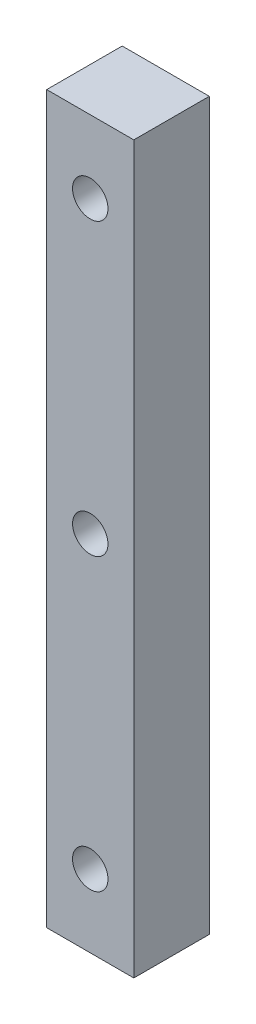
ISO-10303-21;
HEADER;
FILE_DESCRIPTION(('STEP AP214'),'2;1');
FILE_NAME('part.step','',(''),(''),'','','');
FILE_SCHEMA(('AUTOMOTIVE_DESIGN { 1 0 10303 214 1 1 1 1 }'));
ENDSEC;
DATA;
#1=APPLICATION_CONTEXT('core data for automotive mechanical design processes');
#2=APPLICATION_PROTOCOL_DEFINITION('international standard','automotive_design',2000,#1);
#3=PRODUCT_CONTEXT('',#1,'mechanical');
#4=PRODUCT('Part','Part','',(#3));
#5=PRODUCT_RELATED_PRODUCT_CATEGORY('part','',(#4));
#6=PRODUCT_DEFINITION_FORMATION('','',#4);
#7=PRODUCT_DEFINITION_CONTEXT('part definition',#1,'design');
#8=PRODUCT_DEFINITION('design','',#6,#7);
#9=PRODUCT_DEFINITION_SHAPE('','',#8);
#10=(LENGTH_UNIT() NAMED_UNIT(*) SI_UNIT(.MILLI.,.METRE.));
#11=(NAMED_UNIT(*) PLANE_ANGLE_UNIT() SI_UNIT($,.RADIAN.));
#12=(NAMED_UNIT(*) SI_UNIT($,.STERADIAN.) SOLID_ANGLE_UNIT());
#13=UNCERTAINTY_MEASURE_WITH_UNIT(LENGTH_MEASURE(1.E-05),#10,'distance_accuracy_value','');
#14=(GEOMETRIC_REPRESENTATION_CONTEXT(3) GLOBAL_UNCERTAINTY_ASSIGNED_CONTEXT((#13)) GLOBAL_UNIT_ASSIGNED_CONTEXT((#10,
#11,#12)) REPRESENTATION_CONTEXT('',''));
#15=CARTESIAN_POINT('',(0.,0.,0.));
#16=DIRECTION('',(0.,0.,1.));
#17=DIRECTION('',(1.,0.,0.));
#18=AXIS2_PLACEMENT_3D('',#15,#16,#17);
#19=CARTESIAN_POINT('',(0.,25.,0.));
#20=DIRECTION('',(1.,0.,0.));
#21=DIRECTION('',(0.,0.,-1.));
#22=AXIS2_PLACEMENT_3D('',#19,#20,#21);
#23=PLANE('',#22);
#24=DIRECTION('',(0.,0.,1.));
#25=VECTOR('',#24,1.);
#26=CARTESIAN_POINT('',(0.,0.,0.));
#27=LINE('',#26,#25);
#28=CARTESIAN_POINT('',(0.,0.,-2.6));
#29=VERTEX_POINT('',#28);
#30=CARTESIAN_POINT('',(0.,0.,0.));
#31=VERTEX_POINT('',#30);
#32=EDGE_CURVE('E96',#29,#31,#27,.T.);
#33=ORIENTED_EDGE('',*,*,#32,.T.);
#34=DIRECTION('',(0.,-1.,0.));
#35=VECTOR('',#34,1.);
#36=CARTESIAN_POINT('',(0.,25.,0.));
#37=LINE('',#36,#35);
#38=CARTESIAN_POINT('',(0.,25.,0.));
#39=VERTEX_POINT('',#38);
#40=EDGE_CURVE('E11',#39,#31,#37,.T.);
#41=ORIENTED_EDGE('',*,*,#40,.F.);
#42=DIRECTION('',(0.,0.,1.));
#43=VECTOR('',#42,1.);
#44=CARTESIAN_POINT('',(0.,25.,0.));
#45=LINE('',#44,#43);
#46=CARTESIAN_POINT('',(0.,25.,-2.6));
#47=VERTEX_POINT('',#46);
#48=EDGE_CURVE('E84',#47,#39,#45,.T.);
#49=ORIENTED_EDGE('',*,*,#48,.F.);
#50=DIRECTION('',(0.,-1.,0.));
#51=VECTOR('',#50,1.);
#52=CARTESIAN_POINT('',(0.,25.,-2.6));
#53=LINE('',#52,#51);
#54=EDGE_CURVE('E92',#47,#29,#53,.T.);
#55=ORIENTED_EDGE('',*,*,#54,.T.);
#56=EDGE_LOOP('',(#33,#41,#49,#55));
#57=FACE_BOUND('',#56,.T.);
#58=ADVANCED_FACE('F33',(#57),#23,.F.);
#59=CARTESIAN_POINT('',(0.,25.,0.));
#60=DIRECTION('',(0.,0.,-1.));
#61=DIRECTION('',(-1.,0.,0.));
#62=AXIS2_PLACEMENT_3D('',#59,#60,#61);
#63=PLANE('',#62);
#64=CARTESIAN_POINT('',(1.5,22.5,0.));
#65=DIRECTION('',(0.,0.,1.));
#66=DIRECTION('',(1.,0.,0.));
#67=AXIS2_PLACEMENT_3D('',#64,#65,#66);
#68=CIRCLE('',#67,0.610000000000003);
#69=CARTESIAN_POINT('',(2.11,22.5,0.));
#70=VERTEX_POINT('',#69);
#71=EDGE_CURVE('E122',#70,#70,#68,.T.);
#72=ORIENTED_EDGE('',*,*,#71,.F.);
#73=EDGE_LOOP('',(#72));
#74=FACE_BOUND('',#73,.T.);
#75=CARTESIAN_POINT('',(1.5,12.5,0.));
#76=DIRECTION('',(0.,0.,1.));
#77=DIRECTION('',(1.,0.,0.));
#78=AXIS2_PLACEMENT_3D('',#75,#76,#77);
#79=CIRCLE('',#78,0.61);
#80=CARTESIAN_POINT('',(2.11,12.5,0.));
#81=VERTEX_POINT('',#80);
#82=EDGE_CURVE('E116',#81,#81,#79,.T.);
#83=ORIENTED_EDGE('',*,*,#82,.F.);
#84=EDGE_LOOP('',(#83));
#85=FACE_BOUND('',#84,.T.);
#86=CARTESIAN_POINT('',(1.5,2.5,0.));
#87=DIRECTION('',(0.,0.,1.));
#88=DIRECTION('',(1.,0.,0.));
#89=AXIS2_PLACEMENT_3D('',#86,#87,#88);
#90=CIRCLE('',#89,0.61);
#91=CARTESIAN_POINT('',(2.11,2.5,0.));
#92=VERTEX_POINT('',#91);
#93=EDGE_CURVE('E110',#92,#92,#90,.T.);
#94=ORIENTED_EDGE('',*,*,#93,.F.);
#95=EDGE_LOOP('',(#94));
#96=FACE_BOUND('',#95,.T.);
#97=DIRECTION('',(1.,0.,0.));
#98=VECTOR('',#97,1.);
#99=CARTESIAN_POINT('',(0.,0.,0.));
#100=LINE('',#99,#98);
#101=CARTESIAN_POINT('',(3.,0.,0.));
#102=VERTEX_POINT('',#101);
#103=EDGE_CURVE('E88',#31,#102,#100,.T.);
#104=ORIENTED_EDGE('',*,*,#103,.T.);
#105=DIRECTION('',(0.,-1.,0.));
#106=VECTOR('',#105,1.);
#107=CARTESIAN_POINT('',(3.,25.,0.));
#108=LINE('',#107,#106);
#109=CARTESIAN_POINT('',(3.,25.,0.));
#110=VERTEX_POINT('',#109);
#111=EDGE_CURVE('E41',#110,#102,#108,.T.);
#112=ORIENTED_EDGE('',*,*,#111,.F.);
#113=DIRECTION('',(1.,0.,0.));
#114=VECTOR('',#113,1.);
#115=CARTESIAN_POINT('',(0.,25.,0.));
#116=LINE('',#115,#114);
#117=EDGE_CURVE('E79',#39,#110,#116,.T.);
#118=ORIENTED_EDGE('',*,*,#117,.F.);
#119=ORIENTED_EDGE('',*,*,#40,.T.);
#120=EDGE_LOOP('',(#104,#112,#118,#119));
#121=FACE_BOUND('',#120,.T.);
#122=ADVANCED_FACE('F87',(#74,#85,#96,#121),#63,.F.);
#123=CARTESIAN_POINT('',(3.,25.,0.));
#124=DIRECTION('',(-1.,0.,0.));
#125=DIRECTION('',(0.,0.,1.));
#126=AXIS2_PLACEMENT_3D('',#123,#124,#125);
#127=PLANE('',#126);
#128=DIRECTION('',(0.,0.,-1.));
#129=VECTOR('',#128,1.);
#130=CARTESIAN_POINT('',(3.,0.,0.));
#131=LINE('',#130,#129);
#132=CARTESIAN_POINT('',(3.,0.,-2.6));
#133=VERTEX_POINT('',#132);
#134=EDGE_CURVE('E66',#102,#133,#131,.T.);
#135=ORIENTED_EDGE('',*,*,#134,.T.);
#136=DIRECTION('',(0.,-1.,0.));
#137=VECTOR('',#136,1.);
#138=CARTESIAN_POINT('',(3.,25.,-2.6));
#139=LINE('',#138,#137);
#140=CARTESIAN_POINT('',(3.,25.,-2.6));
#141=VERTEX_POINT('',#140);
#142=EDGE_CURVE('E89',#141,#133,#139,.T.);
#143=ORIENTED_EDGE('',*,*,#142,.F.);
#144=DIRECTION('',(0.,0.,-1.));
#145=VECTOR('',#144,1.);
#146=CARTESIAN_POINT('',(3.,25.,0.));
#147=LINE('',#146,#145);
#148=EDGE_CURVE('E82',#110,#141,#147,.T.);
#149=ORIENTED_EDGE('',*,*,#148,.F.);
#150=ORIENTED_EDGE('',*,*,#111,.T.);
#151=EDGE_LOOP('',(#135,#143,#149,#150));
#152=FACE_BOUND('',#151,.T.);
#153=ADVANCED_FACE('F90',(#152),#127,.F.);
#154=CARTESIAN_POINT('',(0.,25.,-2.6));
#155=DIRECTION('',(0.,0.,1.));
#156=DIRECTION('',(1.,0.,0.));
#157=AXIS2_PLACEMENT_3D('',#154,#155,#156);
#158=PLANE('',#157);
#159=CARTESIAN_POINT('',(1.5,22.5,-2.6));
#160=DIRECTION('',(0.,0.,1.));
#161=DIRECTION('',(1.,0.,0.));
#162=AXIS2_PLACEMENT_3D('',#159,#160,#161);
#163=CIRCLE('',#162,0.610000000000003);
#164=CARTESIAN_POINT('',(2.11,22.5,-2.6));
#165=VERTEX_POINT('',#164);
#166=EDGE_CURVE('E99',#165,#165,#163,.T.);
#167=ORIENTED_EDGE('',*,*,#166,.T.);
#168=EDGE_LOOP('',(#167));
#169=FACE_BOUND('',#168,.T.);
#170=CARTESIAN_POINT('',(1.5,12.5,-2.6));
#171=DIRECTION('',(0.,0.,1.));
#172=DIRECTION('',(1.,0.,0.));
#173=AXIS2_PLACEMENT_3D('',#170,#171,#172);
#174=CIRCLE('',#173,0.61);
#175=CARTESIAN_POINT('',(2.11,12.5,-2.6));
#176=VERTEX_POINT('',#175);
#177=EDGE_CURVE('E119',#176,#176,#174,.T.);
#178=ORIENTED_EDGE('',*,*,#177,.T.);
#179=EDGE_LOOP('',(#178));
#180=FACE_BOUND('',#179,.T.);
#181=CARTESIAN_POINT('',(1.5,2.5,-2.6));
#182=DIRECTION('',(0.,0.,1.));
#183=DIRECTION('',(1.,0.,0.));
#184=AXIS2_PLACEMENT_3D('',#181,#182,#183);
#185=CIRCLE('',#184,0.61);
#186=CARTESIAN_POINT('',(2.11,2.5,-2.6));
#187=VERTEX_POINT('',#186);
#188=EDGE_CURVE('E113',#187,#187,#185,.T.);
#189=ORIENTED_EDGE('',*,*,#188,.T.);
#190=EDGE_LOOP('',(#189));
#191=FACE_BOUND('',#190,.T.);
#192=DIRECTION('',(-1.,0.,0.));
#193=VECTOR('',#192,1.);
#194=CARTESIAN_POINT('',(0.,0.,-2.6));
#195=LINE('',#194,#193);
#196=EDGE_CURVE('E72',#133,#29,#195,.T.);
#197=ORIENTED_EDGE('',*,*,#196,.T.);
#198=ORIENTED_EDGE('',*,*,#54,.F.);
#199=DIRECTION('',(-1.,0.,0.));
#200=VECTOR('',#199,1.);
#201=CARTESIAN_POINT('',(0.,25.,-2.6));
#202=LINE('',#201,#200);
#203=EDGE_CURVE('E49',#141,#47,#202,.T.);
#204=ORIENTED_EDGE('',*,*,#203,.F.);
#205=ORIENTED_EDGE('',*,*,#142,.T.);
#206=EDGE_LOOP('',(#197,#198,#204,#205));
#207=FACE_BOUND('',#206,.T.);
#208=ADVANCED_FACE('F104',(#169,#180,#191,#207),#158,.F.);
#209=CARTESIAN_POINT('',(0.,25.,0.));
#210=DIRECTION('',(0.,-1.,0.));
#211=DIRECTION('',(0.,0.,-1.));
#212=AXIS2_PLACEMENT_3D('',#209,#210,#211);
#213=PLANE('',#212);
#214=ORIENTED_EDGE('',*,*,#48,.T.);
#215=ORIENTED_EDGE('',*,*,#117,.T.);
#216=ORIENTED_EDGE('',*,*,#148,.T.);
#217=ORIENTED_EDGE('',*,*,#203,.T.);
#218=EDGE_LOOP('',(#214,#215,#216,#217));
#219=FACE_BOUND('',#218,.T.);
#220=ADVANCED_FACE('F80',(#219),#213,.F.);
#221=CARTESIAN_POINT('',(0.,0.,0.));
#222=DIRECTION('',(0.,-1.,0.));
#223=DIRECTION('',(0.,0.,-1.));
#224=AXIS2_PLACEMENT_3D('',#221,#222,#223);
#225=PLANE('',#224);
#226=ORIENTED_EDGE('',*,*,#32,.F.);
#227=ORIENTED_EDGE('',*,*,#196,.F.);
#228=ORIENTED_EDGE('',*,*,#134,.F.);
#229=ORIENTED_EDGE('',*,*,#103,.F.);
#230=EDGE_LOOP('',(#226,#227,#228,#229));
#231=FACE_BOUND('',#230,.T.);
#232=ADVANCED_FACE('F107',(#231),#225,.T.);
#233=CARTESIAN_POINT('',(1.5,2.5,-2.6));
#234=DIRECTION('',(0.,0.,1.));
#235=DIRECTION('',(1.,0.,0.));
#236=AXIS2_PLACEMENT_3D('',#233,#234,#235);
#237=CYLINDRICAL_SURFACE('',#236,0.61);
#238=ORIENTED_EDGE('',*,*,#188,.F.);
#239=EDGE_LOOP('',(#238));
#240=FACE_BOUND('',#239,.T.);
#241=ORIENTED_EDGE('',*,*,#93,.T.);
#242=EDGE_LOOP('',(#241));
#243=FACE_BOUND('',#242,.T.);
#244=ADVANCED_FACE('F143',(#240,#243),#237,.F.);
#245=CARTESIAN_POINT('',(1.5,12.5,-2.6));
#246=DIRECTION('',(0.,0.,1.));
#247=DIRECTION('',(1.,0.,0.));
#248=AXIS2_PLACEMENT_3D('',#245,#246,#247);
#249=CYLINDRICAL_SURFACE('',#248,0.61);
#250=ORIENTED_EDGE('',*,*,#177,.F.);
#251=EDGE_LOOP('',(#250));
#252=FACE_BOUND('',#251,.T.);
#253=ORIENTED_EDGE('',*,*,#82,.T.);
#254=EDGE_LOOP('',(#253));
#255=FACE_BOUND('',#254,.T.);
#256=ADVANCED_FACE('F133',(#252,#255),#249,.F.);
#257=CARTESIAN_POINT('',(1.5,22.5,-2.6));
#258=DIRECTION('',(0.,0.,1.));
#259=DIRECTION('',(1.,0.,0.));
#260=AXIS2_PLACEMENT_3D('',#257,#258,#259);
#261=CYLINDRICAL_SURFACE('',#260,0.610000000000003);
#262=ORIENTED_EDGE('',*,*,#166,.F.);
#263=EDGE_LOOP('',(#262));
#264=FACE_BOUND('',#263,.T.);
#265=ORIENTED_EDGE('',*,*,#71,.T.);
#266=EDGE_LOOP('',(#265));
#267=FACE_BOUND('',#266,.T.);
#268=ADVANCED_FACE('F130',(#264,#267),#261,.F.);
#269=CLOSED_SHELL('',(#58,#122,#153,#208,#220,#232,#244,#256,#268));
#270=MANIFOLD_SOLID_BREP('B2',#269);
#271=ADVANCED_BREP_SHAPE_REPRESENTATION('',(#18,#270),#14);
#272=SHAPE_DEFINITION_REPRESENTATION(#9,#271);
ENDSEC;
END-ISO-10303-21;
